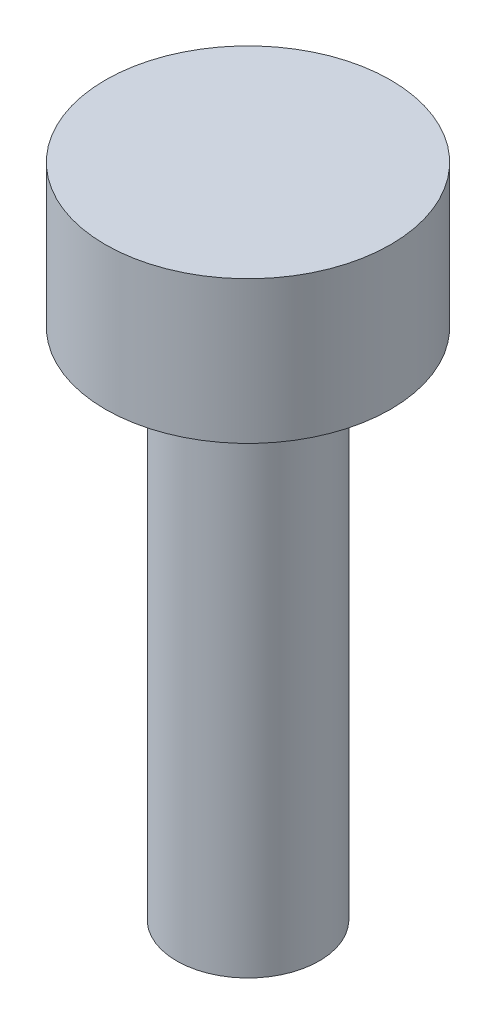
ISO-10303-21;
HEADER;
FILE_DESCRIPTION(('STEP AP214'),'2;1');
FILE_NAME('part.step','',(''),(''),'','','');
FILE_SCHEMA(('AUTOMOTIVE_DESIGN { 1 0 10303 214 1 1 1 1 }'));
ENDSEC;
DATA;
#1=APPLICATION_CONTEXT('core data for automotive mechanical design processes');
#2=APPLICATION_PROTOCOL_DEFINITION('international standard','automotive_design',2000,#1);
#3=PRODUCT_CONTEXT('',#1,'mechanical');
#4=PRODUCT('Part','Part','',(#3));
#5=PRODUCT_RELATED_PRODUCT_CATEGORY('part','',(#4));
#6=PRODUCT_DEFINITION_FORMATION('','',#4);
#7=PRODUCT_DEFINITION_CONTEXT('part definition',#1,'design');
#8=PRODUCT_DEFINITION('design','',#6,#7);
#9=PRODUCT_DEFINITION_SHAPE('','',#8);
#10=(LENGTH_UNIT() NAMED_UNIT(*) SI_UNIT(.MILLI.,.METRE.));
#11=(NAMED_UNIT(*) PLANE_ANGLE_UNIT() SI_UNIT($,.RADIAN.));
#12=(NAMED_UNIT(*) SI_UNIT($,.STERADIAN.) SOLID_ANGLE_UNIT());
#13=UNCERTAINTY_MEASURE_WITH_UNIT(LENGTH_MEASURE(1.E-05),#10,'distance_accuracy_value','');
#14=(GEOMETRIC_REPRESENTATION_CONTEXT(3) GLOBAL_UNCERTAINTY_ASSIGNED_CONTEXT((#13)) GLOBAL_UNIT_ASSIGNED_CONTEXT((#10,
#11,#12)) REPRESENTATION_CONTEXT('',''));
#15=CARTESIAN_POINT('',(0.,0.,0.));
#16=DIRECTION('',(0.,0.,1.));
#17=DIRECTION('',(1.,0.,0.));
#18=AXIS2_PLACEMENT_3D('',#15,#16,#17);
#19=CARTESIAN_POINT('',(0.,36.,0.));
#20=DIRECTION('',(0.,-1.,0.));
#21=DIRECTION('',(0.,0.,-1.));
#22=AXIS2_PLACEMENT_3D('',#19,#20,#21);
#23=CYLINDRICAL_SURFACE('',#22,5.);
#24=CARTESIAN_POINT('',(0.,36.,0.));
#25=DIRECTION('',(0.,1.,0.));
#26=DIRECTION('',(0.,0.,1.));
#27=AXIS2_PLACEMENT_3D('',#24,#25,#26);
#28=CIRCLE('',#27,5.);
#29=CARTESIAN_POINT('',(0.,36.,5.));
#30=VERTEX_POINT('',#29);
#31=EDGE_CURVE('E10',#30,#30,#28,.T.);
#32=ORIENTED_EDGE('',*,*,#31,.F.);
#33=EDGE_LOOP('',(#32));
#34=FACE_BOUND('',#33,.T.);
#35=CARTESIAN_POINT('',(0.,0.,0.));
#36=DIRECTION('',(0.,1.,0.));
#37=DIRECTION('',(0.,0.,1.));
#38=AXIS2_PLACEMENT_3D('',#35,#36,#37);
#39=CIRCLE('',#38,5.);
#40=CARTESIAN_POINT('',(0.,0.,5.));
#41=VERTEX_POINT('',#40);
#42=EDGE_CURVE('E35',#41,#41,#39,.T.);
#43=ORIENTED_EDGE('',*,*,#42,.T.);
#44=EDGE_LOOP('',(#43));
#45=FACE_BOUND('',#44,.T.);
#46=ADVANCED_FACE('F32',(#34,#45),#23,.T.);
#47=CARTESIAN_POINT('',(0.,0.,0.));
#48=DIRECTION('',(0.,1.,0.));
#49=DIRECTION('',(0.,0.,1.));
#50=AXIS2_PLACEMENT_3D('',#47,#48,#49);
#51=PLANE('',#50);
#52=ORIENTED_EDGE('',*,*,#42,.F.);
#53=EDGE_LOOP('',(#52));
#54=FACE_BOUND('',#53,.T.);
#55=ADVANCED_FACE('F55',(#54),#51,.F.);
#56=CARTESIAN_POINT('',(0.,46.,0.));
#57=DIRECTION('',(0.,-1.,0.));
#58=DIRECTION('',(0.,0.,-1.));
#59=AXIS2_PLACEMENT_3D('',#56,#57,#58);
#60=CYLINDRICAL_SURFACE('',#59,10.);
#61=CARTESIAN_POINT('',(0.,46.,0.));
#62=DIRECTION('',(0.,1.,0.));
#63=DIRECTION('',(0.,0.,1.));
#64=AXIS2_PLACEMENT_3D('',#61,#62,#63);
#65=CIRCLE('',#64,10.);
#66=CARTESIAN_POINT('',(0.,46.,10.));
#67=VERTEX_POINT('',#66);
#68=EDGE_CURVE('E42',#67,#67,#65,.T.);
#69=ORIENTED_EDGE('',*,*,#68,.F.);
#70=EDGE_LOOP('',(#69));
#71=FACE_BOUND('',#70,.T.);
#72=CARTESIAN_POINT('',(0.,36.,0.));
#73=DIRECTION('',(0.,1.,0.));
#74=DIRECTION('',(0.,0.,1.));
#75=AXIS2_PLACEMENT_3D('',#72,#73,#74);
#76=CIRCLE('',#75,10.);
#77=CARTESIAN_POINT('',(0.,36.,10.));
#78=VERTEX_POINT('',#77);
#79=EDGE_CURVE('E44',#78,#78,#76,.T.);
#80=ORIENTED_EDGE('',*,*,#79,.T.);
#81=EDGE_LOOP('',(#80));
#82=FACE_BOUND('',#81,.T.);
#83=ADVANCED_FACE('F52',(#71,#82),#60,.T.);
#84=CARTESIAN_POINT('',(0.,46.,0.));
#85=DIRECTION('',(0.,1.,0.));
#86=DIRECTION('',(0.,0.,1.));
#87=AXIS2_PLACEMENT_3D('',#84,#85,#86);
#88=PLANE('',#87);
#89=ORIENTED_EDGE('',*,*,#68,.T.);
#90=EDGE_LOOP('',(#89));
#91=FACE_BOUND('',#90,.T.);
#92=ADVANCED_FACE('F50',(#91),#88,.T.);
#93=CARTESIAN_POINT('',(0.,36.,0.));
#94=DIRECTION('',(0.,1.,0.));
#95=DIRECTION('',(0.,0.,1.));
#96=AXIS2_PLACEMENT_3D('',#93,#94,#95);
#97=PLANE('',#96);
#98=ORIENTED_EDGE('',*,*,#31,.T.);
#99=EDGE_LOOP('',(#98));
#100=FACE_BOUND('',#99,.T.);
#101=ORIENTED_EDGE('',*,*,#79,.F.);
#102=EDGE_LOOP('',(#101));
#103=FACE_BOUND('',#102,.T.);
#104=ADVANCED_FACE('F59',(#100,#103),#97,.F.);
#105=CLOSED_SHELL('',(#46,#55,#83,#92,#104));
#106=MANIFOLD_SOLID_BREP('B2',#105);
#107=ADVANCED_BREP_SHAPE_REPRESENTATION('',(#18,#106),#14);
#108=SHAPE_DEFINITION_REPRESENTATION(#9,#107);
ENDSEC;
END-ISO-10303-21;
